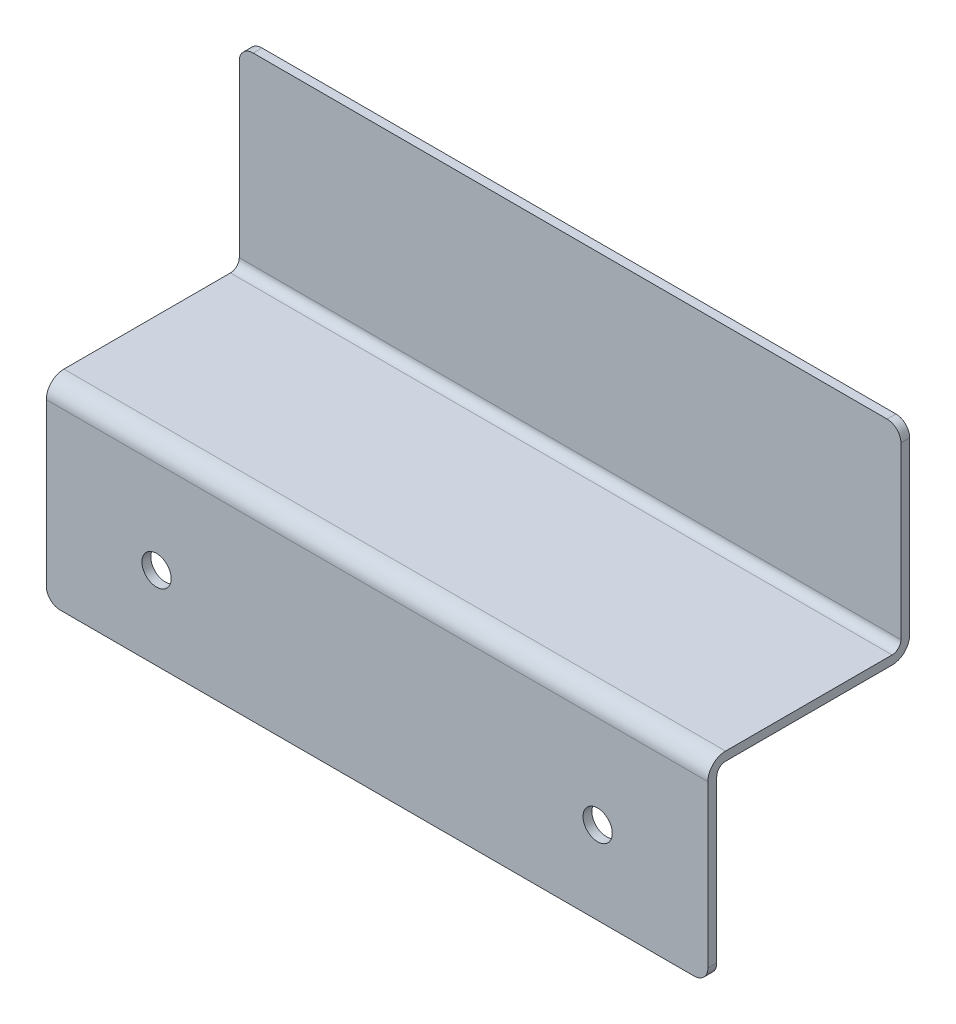
ISO-10303-21;
HEADER;
FILE_DESCRIPTION(('STEP AP214'),'2;1');
FILE_NAME('part.step','',(''),(''),'','','');
FILE_SCHEMA(('AUTOMOTIVE_DESIGN { 1 0 10303 214 1 1 1 1 }'));
ENDSEC;
DATA;
#1=APPLICATION_CONTEXT('core data for automotive mechanical design processes');
#2=APPLICATION_PROTOCOL_DEFINITION('international standard','automotive_design',2000,#1);
#3=PRODUCT_CONTEXT('',#1,'mechanical');
#4=PRODUCT('Part','Part','',(#3));
#5=PRODUCT_RELATED_PRODUCT_CATEGORY('part','',(#4));
#6=PRODUCT_DEFINITION_FORMATION('','',#4);
#7=PRODUCT_DEFINITION_CONTEXT('part definition',#1,'design');
#8=PRODUCT_DEFINITION('design','',#6,#7);
#9=PRODUCT_DEFINITION_SHAPE('','',#8);
#10=(LENGTH_UNIT() NAMED_UNIT(*) SI_UNIT(.MILLI.,.METRE.));
#11=(NAMED_UNIT(*) PLANE_ANGLE_UNIT() SI_UNIT($,.RADIAN.));
#12=(NAMED_UNIT(*) SI_UNIT($,.STERADIAN.) SOLID_ANGLE_UNIT());
#13=UNCERTAINTY_MEASURE_WITH_UNIT(LENGTH_MEASURE(1.E-05),#10,'distance_accuracy_value','');
#14=(GEOMETRIC_REPRESENTATION_CONTEXT(3) GLOBAL_UNCERTAINTY_ASSIGNED_CONTEXT((#13)) GLOBAL_UNIT_ASSIGNED_CONTEXT((#10,
#11,#12)) REPRESENTATION_CONTEXT('',''));
#15=CARTESIAN_POINT('',(0.,0.,0.));
#16=DIRECTION('',(0.,0.,1.));
#17=DIRECTION('',(1.,0.,0.));
#18=AXIS2_PLACEMENT_3D('',#15,#16,#17);
#19=CARTESIAN_POINT('',(152.4,0.,0.));
#20=DIRECTION('',(0.,-1.,0.));
#21=DIRECTION('',(0.,0.,-1.));
#22=AXIS2_PLACEMENT_3D('',#19,#20,#21);
#23=PLANE('',#22);
#24=DIRECTION('',(-1.,0.,0.));
#25=VECTOR('',#24,1.);
#26=CARTESIAN_POINT('',(152.4,0.,-2.032));
#27=LINE('',#26,#25);
#28=CARTESIAN_POINT('',(149.225,0.,-2.032));
#29=VERTEX_POINT('',#28);
#30=CARTESIAN_POINT('',(3.17500000000007,0.,-2.032));
#31=VERTEX_POINT('',#30);
#32=EDGE_CURVE('E188',#29,#31,#27,.T.);
#33=ORIENTED_EDGE('',*,*,#32,.T.);
#34=DIRECTION('',(0.,0.,1.));
#35=VECTOR('',#34,1.);
#36=CARTESIAN_POINT('',(3.17500000000001,0.,0.));
#37=LINE('',#36,#35);
#38=CARTESIAN_POINT('',(3.17500000000007,0.,0.));
#39=VERTEX_POINT('',#38);
#40=EDGE_CURVE('E248',#31,#39,#37,.T.);
#41=ORIENTED_EDGE('',*,*,#40,.T.);
#42=DIRECTION('',(-1.,0.,0.));
#43=VECTOR('',#42,1.);
#44=CARTESIAN_POINT('',(152.4,0.,0.));
#45=LINE('',#44,#43);
#46=CARTESIAN_POINT('',(149.225,0.,0.));
#47=VERTEX_POINT('',#46);
#48=EDGE_CURVE('E173',#47,#39,#45,.T.);
#49=ORIENTED_EDGE('',*,*,#48,.F.);
#50=DIRECTION('',(0.,0.,1.));
#51=VECTOR('',#50,1.);
#52=CARTESIAN_POINT('',(149.225,0.,0.));
#53=LINE('',#52,#51);
#54=EDGE_CURVE('E246',#47,#29,#53,.F.);
#55=ORIENTED_EDGE('',*,*,#54,.T.);
#56=EDGE_LOOP('',(#33,#41,#49,#55));
#57=FACE_BOUND('',#56,.T.);
#58=ADVANCED_FACE('F33',(#57),#23,.F.);
#59=CARTESIAN_POINT('',(152.4,0.,0.));
#60=DIRECTION('',(0.,0.,-1.));
#61=DIRECTION('',(0.,1.,0.));
#62=AXIS2_PLACEMENT_3D('',#59,#60,#61);
#63=PLANE('',#62);
#64=ORIENTED_EDGE('',*,*,#48,.T.);
#65=CARTESIAN_POINT('',(3.17500000000001,-3.175,0.));
#66=DIRECTION('',(0.,0.,-1.));
#67=DIRECTION('',(0.,1.,0.));
#68=AXIS2_PLACEMENT_3D('',#65,#66,#67);
#69=CIRCLE('',#68,3.175);
#70=CARTESIAN_POINT('',(0.,-3.175,0.));
#71=VERTEX_POINT('',#70);
#72=EDGE_CURVE('E252',#39,#71,#69,.F.);
#73=ORIENTED_EDGE('',*,*,#72,.T.);
#74=DIRECTION('',(0.,-1.,0.));
#75=VECTOR('',#74,1.);
#76=CARTESIAN_POINT('',(0.,0.,0.));
#77=LINE('',#76,#75);
#78=CARTESIAN_POINT('',(0.,-42.418,0.));
#79=VERTEX_POINT('',#78);
#80=EDGE_CURVE('E263',#71,#79,#77,.T.);
#81=ORIENTED_EDGE('',*,*,#80,.T.);
#82=DIRECTION('',(-1.,0.,0.));
#83=VECTOR('',#82,1.);
#84=CARTESIAN_POINT('',(152.4,-42.418,0.));
#85=LINE('',#84,#83);
#86=CARTESIAN_POINT('',(152.4,-42.418,0.));
#87=VERTEX_POINT('',#86);
#88=EDGE_CURVE('E163',#79,#87,#85,.F.);
#89=ORIENTED_EDGE('',*,*,#88,.T.);
#90=DIRECTION('',(0.,-1.,0.));
#91=VECTOR('',#90,1.);
#92=CARTESIAN_POINT('',(152.4,0.,0.));
#93=LINE('',#92,#91);
#94=CARTESIAN_POINT('',(152.4,-3.175,0.));
#95=VERTEX_POINT('',#94);
#96=EDGE_CURVE('E182',#95,#87,#93,.T.);
#97=ORIENTED_EDGE('',*,*,#96,.F.);
#98=CARTESIAN_POINT('',(149.225,-3.175,0.));
#99=DIRECTION('',(0.,0.,-1.));
#100=DIRECTION('',(0.,1.,0.));
#101=AXIS2_PLACEMENT_3D('',#98,#99,#100);
#102=CIRCLE('',#101,3.175);
#103=EDGE_CURVE('E58',#95,#47,#102,.F.);
#104=ORIENTED_EDGE('',*,*,#103,.T.);
#105=EDGE_LOOP('',(#64,#73,#81,#89,#97,#104));
#106=FACE_BOUND('',#105,.T.);
#107=ADVANCED_FACE('F335',(#106),#63,.F.);
#108=CARTESIAN_POINT('',(152.4,-44.45,0.));
#109=DIRECTION('',(0.,-1.,0.));
#110=DIRECTION('',(0.,0.,-1.));
#111=AXIS2_PLACEMENT_3D('',#108,#109,#110);
#112=PLANE('',#111);
#113=DIRECTION('',(0.,0.,1.));
#114=VECTOR('',#113,1.);
#115=CARTESIAN_POINT('',(0.,-44.45,0.));
#116=LINE('',#115,#114);
#117=CARTESIAN_POINT('',(0.,-44.45,2.03199999999999));
#118=VERTEX_POINT('',#117);
#119=CARTESIAN_POINT('',(0.,-44.45,40.386));
#120=VERTEX_POINT('',#119);
#121=EDGE_CURVE('E284',#118,#120,#116,.T.);
#122=ORIENTED_EDGE('',*,*,#121,.T.);
#123=DIRECTION('',(-1.,0.,0.));
#124=VECTOR('',#123,1.);
#125=CARTESIAN_POINT('',(152.4,-44.45,40.386));
#126=LINE('',#125,#124);
#127=CARTESIAN_POINT('',(152.4,-44.45,40.386));
#128=VERTEX_POINT('',#127);
#129=EDGE_CURVE('E218',#120,#128,#126,.F.);
#130=ORIENTED_EDGE('',*,*,#129,.T.);
#131=DIRECTION('',(0.,0.,1.));
#132=VECTOR('',#131,1.);
#133=CARTESIAN_POINT('',(152.4,-44.45,0.));
#134=LINE('',#133,#132);
#135=CARTESIAN_POINT('',(152.4,-44.45,2.03199999999999));
#136=VERTEX_POINT('',#135);
#137=EDGE_CURVE('E273',#136,#128,#134,.T.);
#138=ORIENTED_EDGE('',*,*,#137,.F.);
#139=DIRECTION('',(-1.,0.,0.));
#140=VECTOR('',#139,1.);
#141=CARTESIAN_POINT('',(0.,-44.45,2.03199999999999));
#142=LINE('',#141,#140);
#143=EDGE_CURVE('E201',#136,#118,#142,.T.);
#144=ORIENTED_EDGE('',*,*,#143,.T.);
#145=EDGE_LOOP('',(#122,#130,#138,#144));
#146=FACE_BOUND('',#145,.T.);
#147=ADVANCED_FACE('F317',(#146),#112,.F.);
#148=CARTESIAN_POINT('',(152.4,-44.45,44.45));
#149=DIRECTION('',(0.,0.,-1.));
#150=DIRECTION('',(0.,1.,0.));
#151=AXIS2_PLACEMENT_3D('',#148,#149,#150);
#152=PLANE('',#151);
#153=CARTESIAN_POINT('',(25.4,-69.85,44.45));
#154=DIRECTION('',(0.,0.,1.));
#155=DIRECTION('',(1.,0.,0.));
#156=AXIS2_PLACEMENT_3D('',#153,#154,#155);
#157=CIRCLE('',#156,3.3655);
#158=CARTESIAN_POINT('',(28.7655,-69.85,44.45));
#159=VERTEX_POINT('',#158);
#160=EDGE_CURVE('E259',#159,#159,#157,.T.);
#161=ORIENTED_EDGE('',*,*,#160,.F.);
#162=EDGE_LOOP('',(#161));
#163=FACE_BOUND('',#162,.T.);
#164=CARTESIAN_POINT('',(127.,-69.85,44.45));
#165=DIRECTION('',(0.,0.,1.));
#166=DIRECTION('',(1.,0.,0.));
#167=AXIS2_PLACEMENT_3D('',#164,#165,#166);
#168=CIRCLE('',#167,3.36549999999999);
#169=CARTESIAN_POINT('',(130.3655,-69.85,44.45));
#170=VERTEX_POINT('',#169);
#171=EDGE_CURVE('E265',#170,#170,#168,.T.);
#172=ORIENTED_EDGE('',*,*,#171,.F.);
#173=EDGE_LOOP('',(#172));
#174=FACE_BOUND('',#173,.T.);
#175=DIRECTION('',(0.,-1.,0.));
#176=VECTOR('',#175,1.);
#177=CARTESIAN_POINT('',(0.,-44.45,44.45));
#178=LINE('',#177,#176);
#179=CARTESIAN_POINT('',(0.,-48.514,44.45));
#180=VERTEX_POINT('',#179);
#181=CARTESIAN_POINT('',(0.,-85.725,44.45));
#182=VERTEX_POINT('',#181);
#183=EDGE_CURVE('E184',#180,#182,#178,.T.);
#184=ORIENTED_EDGE('',*,*,#183,.T.);
#185=CARTESIAN_POINT('',(3.17500000000001,-85.725,44.45));
#186=DIRECTION('',(0.,0.,-1.));
#187=DIRECTION('',(0.,1.,0.));
#188=AXIS2_PLACEMENT_3D('',#185,#186,#187);
#189=CIRCLE('',#188,3.175);
#190=CARTESIAN_POINT('',(3.17500000000007,-88.9,44.45));
#191=VERTEX_POINT('',#190);
#192=EDGE_CURVE('E244',#182,#191,#189,.F.);
#193=ORIENTED_EDGE('',*,*,#192,.T.);
#194=DIRECTION('',(-1.,0.,0.));
#195=VECTOR('',#194,1.);
#196=CARTESIAN_POINT('',(152.4,-88.9,44.45));
#197=LINE('',#196,#195);
#198=CARTESIAN_POINT('',(149.225,-88.9,44.45));
#199=VERTEX_POINT('',#198);
#200=EDGE_CURVE('E195',#199,#191,#197,.T.);
#201=ORIENTED_EDGE('',*,*,#200,.F.);
#202=CARTESIAN_POINT('',(149.225,-85.725,44.45));
#203=DIRECTION('',(0.,0.,-1.));
#204=DIRECTION('',(0.,1.,0.));
#205=AXIS2_PLACEMENT_3D('',#202,#203,#204);
#206=CIRCLE('',#205,3.175);
#207=CARTESIAN_POINT('',(152.4,-85.725,44.45));
#208=VERTEX_POINT('',#207);
#209=EDGE_CURVE('E242',#199,#208,#206,.F.);
#210=ORIENTED_EDGE('',*,*,#209,.T.);
#211=DIRECTION('',(0.,-1.,0.));
#212=VECTOR('',#211,1.);
#213=CARTESIAN_POINT('',(152.4,-44.45,44.45));
#214=LINE('',#213,#212);
#215=CARTESIAN_POINT('',(152.4,-48.514,44.45));
#216=VERTEX_POINT('',#215);
#217=EDGE_CURVE('E276',#216,#208,#214,.T.);
#218=ORIENTED_EDGE('',*,*,#217,.F.);
#219=DIRECTION('',(-1.,0.,0.));
#220=VECTOR('',#219,1.);
#221=CARTESIAN_POINT('',(152.4,-48.514,44.45));
#222=LINE('',#221,#220);
#223=EDGE_CURVE('E212',#216,#180,#222,.T.);
#224=ORIENTED_EDGE('',*,*,#223,.T.);
#225=EDGE_LOOP('',(#184,#193,#201,#210,#218,#224));
#226=FACE_BOUND('',#225,.T.);
#227=ADVANCED_FACE('F290',(#163,#174,#226),#152,.F.);
#228=CARTESIAN_POINT('',(152.4,-88.9,44.45));
#229=DIRECTION('',(0.,1.,0.));
#230=DIRECTION('',(0.,0.,1.));
#231=AXIS2_PLACEMENT_3D('',#228,#229,#230);
#232=PLANE('',#231);
#233=ORIENTED_EDGE('',*,*,#200,.T.);
#234=DIRECTION('',(0.,0.,-1.));
#235=VECTOR('',#234,1.);
#236=CARTESIAN_POINT('',(3.17500000000001,-88.9,42.418));
#237=LINE('',#236,#235);
#238=CARTESIAN_POINT('',(3.17500000000007,-88.9,42.418));
#239=VERTEX_POINT('',#238);
#240=EDGE_CURVE('E231',#191,#239,#237,.T.);
#241=ORIENTED_EDGE('',*,*,#240,.T.);
#242=DIRECTION('',(-1.,0.,0.));
#243=VECTOR('',#242,1.);
#244=CARTESIAN_POINT('',(152.4,-88.9,42.418));
#245=LINE('',#244,#243);
#246=CARTESIAN_POINT('',(149.225,-88.9,42.418));
#247=VERTEX_POINT('',#246);
#248=EDGE_CURVE('E191',#247,#239,#245,.T.);
#249=ORIENTED_EDGE('',*,*,#248,.F.);
#250=DIRECTION('',(0.,0.,-1.));
#251=VECTOR('',#250,1.);
#252=CARTESIAN_POINT('',(149.225,-88.9,44.45));
#253=LINE('',#252,#251);
#254=EDGE_CURVE('E229',#247,#199,#253,.F.);
#255=ORIENTED_EDGE('',*,*,#254,.T.);
#256=EDGE_LOOP('',(#233,#241,#249,#255));
#257=FACE_BOUND('',#256,.T.);
#258=ADVANCED_FACE('F300',(#257),#232,.F.);
#259=CARTESIAN_POINT('',(152.4,-46.482,42.418));
#260=DIRECTION('',(0.,0.,1.));
#261=DIRECTION('',(0.,-1.,0.));
#262=AXIS2_PLACEMENT_3D('',#259,#260,#261);
#263=PLANE('',#262);
#264=CARTESIAN_POINT('',(25.4,-69.85,42.418));
#265=DIRECTION('',(0.,0.,1.));
#266=DIRECTION('',(0.,-1.,0.));
#267=AXIS2_PLACEMENT_3D('',#264,#265,#266);
#268=CIRCLE('',#267,3.3655);
#269=CARTESIAN_POINT('',(25.4,-73.2155,42.418));
#270=VERTEX_POINT('',#269);
#271=EDGE_CURVE('E37',#270,#270,#268,.T.);
#272=ORIENTED_EDGE('',*,*,#271,.T.);
#273=EDGE_LOOP('',(#272));
#274=FACE_BOUND('',#273,.T.);
#275=CARTESIAN_POINT('',(127.,-69.85,42.418));
#276=DIRECTION('',(0.,0.,1.));
#277=DIRECTION('',(0.,-1.,0.));
#278=AXIS2_PLACEMENT_3D('',#275,#276,#277);
#279=CIRCLE('',#278,3.36549999999999);
#280=CARTESIAN_POINT('',(127.,-73.2155,42.418));
#281=VERTEX_POINT('',#280);
#282=EDGE_CURVE('E257',#281,#281,#279,.T.);
#283=ORIENTED_EDGE('',*,*,#282,.T.);
#284=EDGE_LOOP('',(#283));
#285=FACE_BOUND('',#284,.T.);
#286=ORIENTED_EDGE('',*,*,#248,.T.);
#287=CARTESIAN_POINT('',(3.17500000000001,-85.725,42.418));
#288=DIRECTION('',(0.,0.,1.));
#289=DIRECTION('',(0.,-1.,0.));
#290=AXIS2_PLACEMENT_3D('',#287,#288,#289);
#291=CIRCLE('',#290,3.175);
#292=CARTESIAN_POINT('',(0.,-85.725,42.418));
#293=VERTEX_POINT('',#292);
#294=EDGE_CURVE('E236',#239,#293,#291,.F.);
#295=ORIENTED_EDGE('',*,*,#294,.T.);
#296=DIRECTION('',(0.,1.,0.));
#297=VECTOR('',#296,1.);
#298=CARTESIAN_POINT('',(0.,-46.482,42.418));
#299=LINE('',#298,#297);
#300=CARTESIAN_POINT('',(0.,-48.514,42.418));
#301=VERTEX_POINT('',#300);
#302=EDGE_CURVE('E179',#293,#301,#299,.T.);
#303=ORIENTED_EDGE('',*,*,#302,.T.);
#304=DIRECTION('',(-1.,0.,0.));
#305=VECTOR('',#304,1.);
#306=CARTESIAN_POINT('',(152.4,-48.514,42.418));
#307=LINE('',#306,#305);
#308=CARTESIAN_POINT('',(152.4,-48.514,42.418));
#309=VERTEX_POINT('',#308);
#310=EDGE_CURVE('E158',#301,#309,#307,.F.);
#311=ORIENTED_EDGE('',*,*,#310,.T.);
#312=DIRECTION('',(0.,1.,0.));
#313=VECTOR('',#312,1.);
#314=CARTESIAN_POINT('',(152.4,-46.482,42.418));
#315=LINE('',#314,#313);
#316=CARTESIAN_POINT('',(152.4,-85.725,42.418));
#317=VERTEX_POINT('',#316);
#318=EDGE_CURVE('E279',#317,#309,#315,.T.);
#319=ORIENTED_EDGE('',*,*,#318,.F.);
#320=CARTESIAN_POINT('',(149.225,-85.725,42.418));
#321=DIRECTION('',(0.,0.,1.));
#322=DIRECTION('',(0.,-1.,0.));
#323=AXIS2_PLACEMENT_3D('',#320,#321,#322);
#324=CIRCLE('',#323,3.175);
#325=EDGE_CURVE('E234',#317,#247,#324,.F.);
#326=ORIENTED_EDGE('',*,*,#325,.T.);
#327=EDGE_LOOP('',(#286,#295,#303,#311,#319,#326));
#328=FACE_BOUND('',#327,.T.);
#329=ADVANCED_FACE('F303',(#274,#285,#328),#263,.F.);
#330=CARTESIAN_POINT('',(152.4,-46.482,-2.03200000000001));
#331=DIRECTION('',(0.,1.,0.));
#332=DIRECTION('',(0.,0.,1.));
#333=AXIS2_PLACEMENT_3D('',#330,#331,#332);
#334=PLANE('',#333);
#335=DIRECTION('',(0.,0.,-1.));
#336=VECTOR('',#335,1.);
#337=CARTESIAN_POINT('',(0.,-46.482,-2.03200000000001));
#338=LINE('',#337,#336);
#339=CARTESIAN_POINT('',(0.,-46.482,40.386));
#340=VERTEX_POINT('',#339);
#341=CARTESIAN_POINT('',(0.,-46.482,2.03199999999999));
#342=VERTEX_POINT('',#341);
#343=EDGE_CURVE('E169',#340,#342,#338,.T.);
#344=ORIENTED_EDGE('',*,*,#343,.T.);
#345=DIRECTION('',(-1.,0.,0.));
#346=VECTOR('',#345,1.);
#347=CARTESIAN_POINT('',(152.4,-46.482,2.03199999999999));
#348=LINE('',#347,#346);
#349=CARTESIAN_POINT('',(152.4,-46.482,2.03199999999999));
#350=VERTEX_POINT('',#349);
#351=EDGE_CURVE('E227',#342,#350,#348,.F.);
#352=ORIENTED_EDGE('',*,*,#351,.T.);
#353=DIRECTION('',(0.,0.,-1.));
#354=VECTOR('',#353,1.);
#355=CARTESIAN_POINT('',(152.4,-46.482,-2.03200000000001));
#356=LINE('',#355,#354);
#357=CARTESIAN_POINT('',(152.4,-46.482,40.386));
#358=VERTEX_POINT('',#357);
#359=EDGE_CURVE('E172',#358,#350,#356,.T.);
#360=ORIENTED_EDGE('',*,*,#359,.F.);
#361=DIRECTION('',(-1.,0.,0.));
#362=VECTOR('',#361,1.);
#363=CARTESIAN_POINT('',(0.,-46.482,40.386));
#364=LINE('',#363,#362);
#365=EDGE_CURVE('E156',#358,#340,#364,.T.);
#366=ORIENTED_EDGE('',*,*,#365,.T.);
#367=EDGE_LOOP('',(#344,#352,#360,#366));
#368=FACE_BOUND('',#367,.T.);
#369=ADVANCED_FACE('F168',(#368),#334,.F.);
#370=CARTESIAN_POINT('',(152.4,0.,-2.032));
#371=DIRECTION('',(0.,0.,1.));
#372=DIRECTION('',(0.,-1.,0.));
#373=AXIS2_PLACEMENT_3D('',#370,#371,#372);
#374=PLANE('',#373);
#375=DIRECTION('',(0.,1.,0.));
#376=VECTOR('',#375,1.);
#377=CARTESIAN_POINT('',(0.,0.,-2.032));
#378=LINE('',#377,#376);
#379=CARTESIAN_POINT('',(0.,-42.418,-2.03200000000001));
#380=VERTEX_POINT('',#379);
#381=CARTESIAN_POINT('',(0.,-3.175,-2.032));
#382=VERTEX_POINT('',#381);
#383=EDGE_CURVE('E178',#380,#382,#378,.T.);
#384=ORIENTED_EDGE('',*,*,#383,.T.);
#385=CARTESIAN_POINT('',(3.17500000000001,-3.175,-2.032));
#386=DIRECTION('',(0.,0.,1.));
#387=DIRECTION('',(0.,-1.,0.));
#388=AXIS2_PLACEMENT_3D('',#385,#386,#387);
#389=CIRCLE('',#388,3.175);
#390=EDGE_CURVE('E255',#382,#31,#389,.F.);
#391=ORIENTED_EDGE('',*,*,#390,.T.);
#392=ORIENTED_EDGE('',*,*,#32,.F.);
#393=CARTESIAN_POINT('',(149.225,-3.175,-2.032));
#394=DIRECTION('',(0.,0.,1.));
#395=DIRECTION('',(0.,-1.,0.));
#396=AXIS2_PLACEMENT_3D('',#393,#394,#395);
#397=CIRCLE('',#396,3.175);
#398=CARTESIAN_POINT('',(152.4,-3.175,-2.032));
#399=VERTEX_POINT('',#398);
#400=EDGE_CURVE('E50',#29,#399,#397,.F.);
#401=ORIENTED_EDGE('',*,*,#400,.T.);
#402=DIRECTION('',(0.,1.,0.));
#403=VECTOR('',#402,1.);
#404=CARTESIAN_POINT('',(152.4,0.,-2.032));
#405=LINE('',#404,#403);
#406=CARTESIAN_POINT('',(152.4,-42.418,-2.03200000000001));
#407=VERTEX_POINT('',#406);
#408=EDGE_CURVE('E192',#407,#399,#405,.T.);
#409=ORIENTED_EDGE('',*,*,#408,.F.);
#410=DIRECTION('',(-1.,0.,0.));
#411=VECTOR('',#410,1.);
#412=CARTESIAN_POINT('',(152.4,-42.418,-2.03200000000001));
#413=LINE('',#412,#411);
#414=EDGE_CURVE('E224',#407,#380,#413,.T.);
#415=ORIENTED_EDGE('',*,*,#414,.T.);
#416=EDGE_LOOP('',(#384,#391,#392,#401,#409,#415));
#417=FACE_BOUND('',#416,.T.);
#418=ADVANCED_FACE('F331',(#417),#374,.F.);
#419=CARTESIAN_POINT('',(152.4,0.,0.));
#420=DIRECTION('',(-1.,0.,0.));
#421=DIRECTION('',(0.,0.,1.));
#422=AXIS2_PLACEMENT_3D('',#419,#420,#421);
#423=PLANE('',#422);
#424=ORIENTED_EDGE('',*,*,#217,.T.);
#425=DIRECTION('',(0.,0.,-1.));
#426=VECTOR('',#425,1.);
#427=CARTESIAN_POINT('',(152.4,-85.725,0.));
#428=LINE('',#427,#426);
#429=EDGE_CURVE('E11',#208,#317,#428,.T.);
#430=ORIENTED_EDGE('',*,*,#429,.T.);
#431=ORIENTED_EDGE('',*,*,#318,.T.);
#432=CARTESIAN_POINT('',(152.4,-48.514,40.386));
#433=DIRECTION('',(-1.,0.,0.));
#434=DIRECTION('',(0.,0.,1.));
#435=AXIS2_PLACEMENT_3D('',#432,#433,#434);
#436=CIRCLE('',#435,2.032);
#437=EDGE_CURVE('E162',#309,#358,#436,.T.);
#438=ORIENTED_EDGE('',*,*,#437,.T.);
#439=ORIENTED_EDGE('',*,*,#359,.T.);
#440=CARTESIAN_POINT('',(152.4,-42.418,2.03199999999999));
#441=DIRECTION('',(-1.,0.,0.));
#442=DIRECTION('',(0.,0.,1.));
#443=AXIS2_PLACEMENT_3D('',#440,#441,#442);
#444=CIRCLE('',#443,4.064);
#445=EDGE_CURVE('E220',#350,#407,#444,.F.);
#446=ORIENTED_EDGE('',*,*,#445,.T.);
#447=ORIENTED_EDGE('',*,*,#408,.T.);
#448=DIRECTION('',(0.,0.,1.));
#449=VECTOR('',#448,1.);
#450=CARTESIAN_POINT('',(152.4,-3.175,0.));
#451=LINE('',#450,#449);
#452=EDGE_CURVE('E42',#399,#95,#451,.T.);
#453=ORIENTED_EDGE('',*,*,#452,.T.);
#454=ORIENTED_EDGE('',*,*,#96,.T.);
#455=CARTESIAN_POINT('',(152.4,-42.418,2.03199999999999));
#456=DIRECTION('',(-1.,0.,0.));
#457=DIRECTION('',(0.,0.,1.));
#458=AXIS2_PLACEMENT_3D('',#455,#456,#457);
#459=CIRCLE('',#458,2.032);
#460=EDGE_CURVE('E210',#87,#136,#459,.T.);
#461=ORIENTED_EDGE('',*,*,#460,.T.);
#462=ORIENTED_EDGE('',*,*,#137,.T.);
#463=CARTESIAN_POINT('',(152.4,-48.514,40.386));
#464=DIRECTION('',(-1.,0.,0.));
#465=DIRECTION('',(0.,0.,1.));
#466=AXIS2_PLACEMENT_3D('',#463,#464,#465);
#467=CIRCLE('',#466,4.064);
#468=EDGE_CURVE('E222',#128,#216,#467,.F.);
#469=ORIENTED_EDGE('',*,*,#468,.T.);
#470=EDGE_LOOP('',(#424,#430,#431,#438,#439,#446,#447,#453,#454,#461,#462,#469));
#471=FACE_BOUND('',#470,.T.);
#472=ADVANCED_FACE('F310',(#471),#423,.F.);
#473=CARTESIAN_POINT('',(0.,0.,0.));
#474=DIRECTION('',(-1.,0.,0.));
#475=DIRECTION('',(0.,0.,1.));
#476=AXIS2_PLACEMENT_3D('',#473,#474,#475);
#477=PLANE('',#476);
#478=ORIENTED_EDGE('',*,*,#302,.F.);
#479=DIRECTION('',(0.,0.,-1.));
#480=VECTOR('',#479,1.);
#481=CARTESIAN_POINT('',(0.,-85.725,44.45));
#482=LINE('',#481,#480);
#483=EDGE_CURVE('E240',#293,#182,#482,.F.);
#484=ORIENTED_EDGE('',*,*,#483,.T.);
#485=ORIENTED_EDGE('',*,*,#183,.F.);
#486=CARTESIAN_POINT('',(0.,-48.514,40.386));
#487=DIRECTION('',(-1.,0.,0.));
#488=DIRECTION('',(0.,0.,1.));
#489=AXIS2_PLACEMENT_3D('',#486,#487,#488);
#490=CIRCLE('',#489,4.064);
#491=EDGE_CURVE('E216',#180,#120,#490,.T.);
#492=ORIENTED_EDGE('',*,*,#491,.T.);
#493=ORIENTED_EDGE('',*,*,#121,.F.);
#494=CARTESIAN_POINT('',(0.,-42.418,2.03199999999999));
#495=DIRECTION('',(-1.,0.,0.));
#496=DIRECTION('',(0.,0.,1.));
#497=AXIS2_PLACEMENT_3D('',#494,#495,#496);
#498=CIRCLE('',#497,2.032);
#499=EDGE_CURVE('E207',#118,#79,#498,.F.);
#500=ORIENTED_EDGE('',*,*,#499,.T.);
#501=ORIENTED_EDGE('',*,*,#80,.F.);
#502=DIRECTION('',(0.,0.,1.));
#503=VECTOR('',#502,1.);
#504=CARTESIAN_POINT('',(0.,-3.175,-2.032));
#505=LINE('',#504,#503);
#506=EDGE_CURVE('E238',#71,#382,#505,.F.);
#507=ORIENTED_EDGE('',*,*,#506,.T.);
#508=ORIENTED_EDGE('',*,*,#383,.F.);
#509=CARTESIAN_POINT('',(0.,-42.418,2.03199999999999));
#510=DIRECTION('',(-1.,0.,0.));
#511=DIRECTION('',(0.,0.,1.));
#512=AXIS2_PLACEMENT_3D('',#509,#510,#511);
#513=CIRCLE('',#512,4.064);
#514=EDGE_CURVE('E177',#380,#342,#513,.T.);
#515=ORIENTED_EDGE('',*,*,#514,.T.);
#516=ORIENTED_EDGE('',*,*,#343,.F.);
#517=CARTESIAN_POINT('',(0.,-48.514,40.386));
#518=DIRECTION('',(-1.,0.,0.));
#519=DIRECTION('',(0.,0.,1.));
#520=AXIS2_PLACEMENT_3D('',#517,#518,#519);
#521=CIRCLE('',#520,2.032);
#522=EDGE_CURVE('E152',#340,#301,#521,.F.);
#523=ORIENTED_EDGE('',*,*,#522,.T.);
#524=EDGE_LOOP('',(#478,#484,#485,#492,#493,#500,#501,#507,#508,#515,#516,#523));
#525=FACE_BOUND('',#524,.T.);
#526=ADVANCED_FACE('F175',(#525),#477,.T.);
#527=CARTESIAN_POINT('',(152.4,-48.514,40.386));
#528=DIRECTION('',(1.,0.,0.));
#529=DIRECTION('',(0.,0.,-1.));
#530=AXIS2_PLACEMENT_3D('',#527,#528,#529);
#531=CYLINDRICAL_SURFACE('',#530,2.032);
#532=ORIENTED_EDGE('',*,*,#437,.F.);
#533=ORIENTED_EDGE('',*,*,#310,.F.);
#534=ORIENTED_EDGE('',*,*,#522,.F.);
#535=ORIENTED_EDGE('',*,*,#365,.F.);
#536=EDGE_LOOP('',(#532,#533,#534,#535));
#537=FACE_BOUND('',#536,.T.);
#538=ADVANCED_FACE('F155',(#537),#531,.F.);
#539=CARTESIAN_POINT('',(152.4,-42.418,2.03199999999999));
#540=DIRECTION('',(1.,0.,0.));
#541=DIRECTION('',(0.,0.,-1.));
#542=AXIS2_PLACEMENT_3D('',#539,#540,#541);
#543=CYLINDRICAL_SURFACE('',#542,2.032);
#544=ORIENTED_EDGE('',*,*,#460,.F.);
#545=ORIENTED_EDGE('',*,*,#88,.F.);
#546=ORIENTED_EDGE('',*,*,#499,.F.);
#547=ORIENTED_EDGE('',*,*,#143,.F.);
#548=EDGE_LOOP('',(#544,#545,#546,#547));
#549=FACE_BOUND('',#548,.T.);
#550=ADVANCED_FACE('F322',(#549),#543,.F.);
#551=CARTESIAN_POINT('',(152.4,-48.514,40.386));
#552=DIRECTION('',(-1.,0.,0.));
#553=DIRECTION('',(0.,0.,1.));
#554=AXIS2_PLACEMENT_3D('',#551,#552,#553);
#555=CYLINDRICAL_SURFACE('',#554,4.064);
#556=ORIENTED_EDGE('',*,*,#468,.F.);
#557=ORIENTED_EDGE('',*,*,#129,.F.);
#558=ORIENTED_EDGE('',*,*,#491,.F.);
#559=ORIENTED_EDGE('',*,*,#223,.F.);
#560=EDGE_LOOP('',(#556,#557,#558,#559));
#561=FACE_BOUND('',#560,.T.);
#562=ADVANCED_FACE('F313',(#561),#555,.T.);
#563=CARTESIAN_POINT('',(152.4,-42.418,2.03199999999999));
#564=DIRECTION('',(-1.,0.,0.));
#565=DIRECTION('',(0.,0.,1.));
#566=AXIS2_PLACEMENT_3D('',#563,#564,#565);
#567=CYLINDRICAL_SURFACE('',#566,4.064);
#568=ORIENTED_EDGE('',*,*,#445,.F.);
#569=ORIENTED_EDGE('',*,*,#351,.F.);
#570=ORIENTED_EDGE('',*,*,#514,.F.);
#571=ORIENTED_EDGE('',*,*,#414,.F.);
#572=EDGE_LOOP('',(#568,#569,#570,#571));
#573=FACE_BOUND('',#572,.T.);
#574=ADVANCED_FACE('F352',(#573),#567,.T.);
#575=CARTESIAN_POINT('',(3.17500000000001,-85.725,44.45));
#576=DIRECTION('',(0.,0.,1.));
#577=DIRECTION('',(1.,0.,0.));
#578=AXIS2_PLACEMENT_3D('',#575,#576,#577);
#579=CYLINDRICAL_SURFACE('',#578,3.175);
#580=ORIENTED_EDGE('',*,*,#192,.F.);
#581=ORIENTED_EDGE('',*,*,#483,.F.);
#582=ORIENTED_EDGE('',*,*,#294,.F.);
#583=ORIENTED_EDGE('',*,*,#240,.F.);
#584=EDGE_LOOP('',(#580,#581,#582,#583));
#585=FACE_BOUND('',#584,.T.);
#586=ADVANCED_FACE('F297',(#585),#579,.T.);
#587=CARTESIAN_POINT('',(3.17500000000001,-3.175,0.));
#588=DIRECTION('',(0.,0.,-1.));
#589=DIRECTION('',(-1.,0.,0.));
#590=AXIS2_PLACEMENT_3D('',#587,#588,#589);
#591=CYLINDRICAL_SURFACE('',#590,3.175);
#592=ORIENTED_EDGE('',*,*,#390,.F.);
#593=ORIENTED_EDGE('',*,*,#506,.F.);
#594=ORIENTED_EDGE('',*,*,#72,.F.);
#595=ORIENTED_EDGE('',*,*,#40,.F.);
#596=EDGE_LOOP('',(#592,#593,#594,#595));
#597=FACE_BOUND('',#596,.T.);
#598=ADVANCED_FACE('F329',(#597),#591,.T.);
#599=CARTESIAN_POINT('',(149.225,-85.725,0.));
#600=DIRECTION('',(0.,0.,-1.));
#601=DIRECTION('',(-1.,0.,0.));
#602=AXIS2_PLACEMENT_3D('',#599,#600,#601);
#603=CYLINDRICAL_SURFACE('',#602,3.175);
#604=ORIENTED_EDGE('',*,*,#209,.F.);
#605=ORIENTED_EDGE('',*,*,#254,.F.);
#606=ORIENTED_EDGE('',*,*,#325,.F.);
#607=ORIENTED_EDGE('',*,*,#429,.F.);
#608=EDGE_LOOP('',(#604,#605,#606,#607));
#609=FACE_BOUND('',#608,.T.);
#610=ADVANCED_FACE('F308',(#609),#603,.T.);
#611=CARTESIAN_POINT('',(149.225,-3.175,0.));
#612=DIRECTION('',(0.,0.,1.));
#613=DIRECTION('',(1.,0.,0.));
#614=AXIS2_PLACEMENT_3D('',#611,#612,#613);
#615=CYLINDRICAL_SURFACE('',#614,3.175);
#616=ORIENTED_EDGE('',*,*,#400,.F.);
#617=ORIENTED_EDGE('',*,*,#54,.F.);
#618=ORIENTED_EDGE('',*,*,#103,.F.);
#619=ORIENTED_EDGE('',*,*,#452,.F.);
#620=EDGE_LOOP('',(#616,#617,#618,#619));
#621=FACE_BOUND('',#620,.T.);
#622=ADVANCED_FACE('F35',(#621),#615,.T.);
#623=CARTESIAN_POINT('',(127.,-69.85,-2.03200000000001));
#624=DIRECTION('',(0.,0.,1.));
#625=DIRECTION('',(1.,0.,0.));
#626=AXIS2_PLACEMENT_3D('',#623,#624,#625);
#627=CYLINDRICAL_SURFACE('',#626,3.36549999999999);
#628=ORIENTED_EDGE('',*,*,#171,.T.);
#629=EDGE_LOOP('',(#628));
#630=FACE_BOUND('',#629,.T.);
#631=ORIENTED_EDGE('',*,*,#282,.F.);
#632=EDGE_LOOP('',(#631));
#633=FACE_BOUND('',#632,.T.);
#634=ADVANCED_FACE('F363',(#630,#633),#627,.F.);
#635=CARTESIAN_POINT('',(25.4,-69.85,-2.03200000000001));
#636=DIRECTION('',(0.,0.,1.));
#637=DIRECTION('',(1.,0.,0.));
#638=AXIS2_PLACEMENT_3D('',#635,#636,#637);
#639=CYLINDRICAL_SURFACE('',#638,3.3655);
#640=ORIENTED_EDGE('',*,*,#160,.T.);
#641=EDGE_LOOP('',(#640));
#642=FACE_BOUND('',#641,.T.);
#643=ORIENTED_EDGE('',*,*,#271,.F.);
#644=EDGE_LOOP('',(#643));
#645=FACE_BOUND('',#644,.T.);
#646=ADVANCED_FACE('F367',(#642,#645),#639,.F.);
#647=CLOSED_SHELL('',(#58,#107,#147,#227,#258,#329,#369,#418,#472,#526,#538,#550,#562,#574,#586,
#598,#610,#622,#634,#646));
#648=MANIFOLD_SOLID_BREP('B2',#647);
#649=ADVANCED_BREP_SHAPE_REPRESENTATION('',(#18,#648),#14);
#650=SHAPE_DEFINITION_REPRESENTATION(#9,#649);
ENDSEC;
END-ISO-10303-21;
